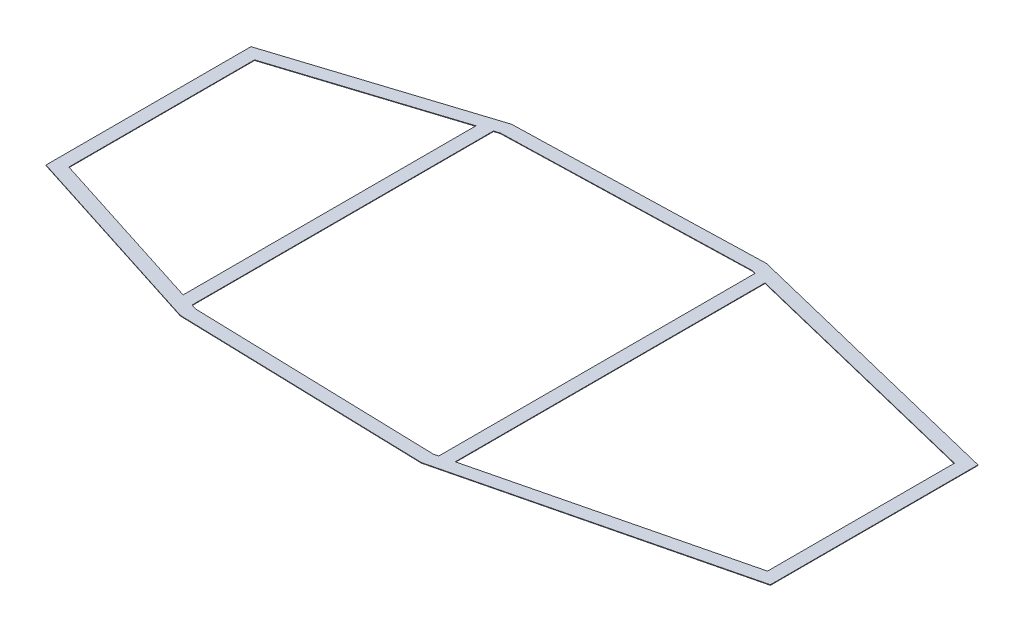
ISO-10303-21;
HEADER;
FILE_DESCRIPTION(('STEP AP214'),'2;1');
FILE_NAME('part.step','',(''),(''),'','','');
FILE_SCHEMA(('AUTOMOTIVE_DESIGN { 1 0 10303 214 1 1 1 1 }'));
ENDSEC;
DATA;
#1=APPLICATION_CONTEXT('core data for automotive mechanical design processes');
#2=APPLICATION_PROTOCOL_DEFINITION('international standard','automotive_design',2000,#1);
#3=PRODUCT_CONTEXT('',#1,'mechanical');
#4=PRODUCT('Part','Part','',(#3));
#5=PRODUCT_RELATED_PRODUCT_CATEGORY('part','',(#4));
#6=PRODUCT_DEFINITION_FORMATION('','',#4);
#7=PRODUCT_DEFINITION_CONTEXT('part definition',#1,'design');
#8=PRODUCT_DEFINITION('design','',#6,#7);
#9=PRODUCT_DEFINITION_SHAPE('','',#8);
#10=(LENGTH_UNIT() NAMED_UNIT(*) SI_UNIT(.MILLI.,.METRE.));
#11=(NAMED_UNIT(*) PLANE_ANGLE_UNIT() SI_UNIT($,.RADIAN.));
#12=(NAMED_UNIT(*) SI_UNIT($,.STERADIAN.) SOLID_ANGLE_UNIT());
#13=UNCERTAINTY_MEASURE_WITH_UNIT(LENGTH_MEASURE(1.E-05),#10,'distance_accuracy_value','');
#14=(GEOMETRIC_REPRESENTATION_CONTEXT(3) GLOBAL_UNCERTAINTY_ASSIGNED_CONTEXT((#13)) GLOBAL_UNIT_ASSIGNED_CONTEXT((#10,
#11,#12)) REPRESENTATION_CONTEXT('',''));
#15=CARTESIAN_POINT('',(0.,0.,0.));
#16=DIRECTION('',(0.,0.,1.));
#17=DIRECTION('',(1.,0.,0.));
#18=AXIS2_PLACEMENT_3D('',#15,#16,#17);
#19=CARTESIAN_POINT('',(708.,61.3,193.60723204996));
#20=DIRECTION('',(0.,-1.,0.));
#21=DIRECTION('',(0.,0.,-1.));
#22=AXIS2_PLACEMENT_3D('',#19,#20,#21);
#23=PLANE('',#22);
#24=DIRECTION('',(0.95256986702521,0.,0.304319977056343));
#25=VECTOR('',#24,1.);
#26=CARTESIAN_POINT('',(1050.,61.3,276.622068956592));
#27=LINE('',#26,#25);
#28=CARTESIAN_POINT('',(733.,61.3,175.349253107266));
#29=VERTEX_POINT('',#28);
#30=CARTESIAN_POINT('',(1050.,61.3,276.622068956592));
#31=VERTEX_POINT('',#30);
#32=EDGE_CURVE('E232',#29,#31,#27,.T.);
#33=ORIENTED_EDGE('',*,*,#32,.F.);
#34=DIRECTION('',(0.,0.,1.));
#35=VECTOR('',#34,1.);
#36=CARTESIAN_POINT('',(733.,61.3,175.349253107266));
#37=LINE('',#36,#35);
#38=CARTESIAN_POINT('',(733.,61.3,-175.349253107266));
#39=VERTEX_POINT('',#38);
#40=EDGE_CURVE('E240',#39,#29,#37,.T.);
#41=ORIENTED_EDGE('',*,*,#40,.F.);
#42=DIRECTION('',(-0.95256986702521,0.,0.304319977056343));
#43=VECTOR('',#42,1.);
#44=CARTESIAN_POINT('',(1050.,61.3,-276.622068956592));
#45=LINE('',#44,#43);
#46=CARTESIAN_POINT('',(1050.,61.3,-276.622068956592));
#47=VERTEX_POINT('',#46);
#48=EDGE_CURVE('E237',#47,#39,#45,.T.);
#49=ORIENTED_EDGE('',*,*,#48,.F.);
#50=DIRECTION('',(0.,0.,-1.));
#51=VECTOR('',#50,1.);
#52=CARTESIAN_POINT('',(1050.,61.3,276.622068956592));
#53=LINE('',#52,#51);
#54=EDGE_CURVE('E234',#31,#47,#53,.T.);
#55=ORIENTED_EDGE('',*,*,#54,.F.);
#56=EDGE_LOOP('',(#33,#41,#49,#55));
#57=FACE_BOUND('',#56,.T.);
#58=DIRECTION('',(0.95256986702521,0.,0.304319977056344));
#59=VECTOR('',#58,1.);
#60=CARTESIAN_POINT('',(1080.84743547171,61.3,312.721773603335));
#61=LINE('',#60,#59);
#62=CARTESIAN_POINT('',(708.,61.3,193.60723204996));
#63=VERTEX_POINT('',#62);
#64=CARTESIAN_POINT('',(1080.84743547171,61.3,312.721773603335));
#65=VERTEX_POINT('',#64);
#66=EDGE_CURVE('E322',#63,#65,#61,.T.);
#67=ORIENTED_EDGE('',*,*,#66,.T.);
#68=DIRECTION('',(0.999608031632854,0.,0.0279961264300995));
#69=VECTOR('',#68,1.);
#70=CARTESIAN_POINT('',(1549.46515586412,61.3,325.846398988808));
#71=LINE('',#70,#69);
#72=CARTESIAN_POINT('',(1549.46515586412,61.3,325.846398988808));
#73=VERTEX_POINT('',#72);
#74=EDGE_CURVE('E325',#65,#73,#71,.T.);
#75=ORIENTED_EDGE('',*,*,#74,.T.);
#76=DIRECTION('',(0.971239772329955,0.,-0.238103558655592));
#77=VECTOR('',#76,1.);
#78=CARTESIAN_POINT('',(1549.46515586412,61.3,325.846398988808));
#79=LINE('',#78,#77);
#80=CARTESIAN_POINT('',(2078.8,61.3,196.077711894373));
#81=VERTEX_POINT('',#80);
#82=EDGE_CURVE('E328',#73,#81,#79,.T.);
#83=ORIENTED_EDGE('',*,*,#82,.T.);
#84=DIRECTION('',(0.,0.,-1.));
#85=VECTOR('',#84,1.);
#86=CARTESIAN_POINT('',(2078.8,61.3,-196.077711894373));
#87=LINE('',#86,#85);
#88=CARTESIAN_POINT('',(2078.8,61.3,-196.077711894373));
#89=VERTEX_POINT('',#88);
#90=EDGE_CURVE('E330',#81,#89,#87,.T.);
#91=ORIENTED_EDGE('',*,*,#90,.T.);
#92=DIRECTION('',(-0.971239772329955,0.,-0.238103558655592));
#93=VECTOR('',#92,1.);
#94=CARTESIAN_POINT('',(1549.46515586412,61.3,-325.846398988808));
#95=LINE('',#94,#93);
#96=CARTESIAN_POINT('',(1549.46515586412,61.3,-325.846398988808));
#97=VERTEX_POINT('',#96);
#98=EDGE_CURVE('E332',#89,#97,#95,.T.);
#99=ORIENTED_EDGE('',*,*,#98,.T.);
#100=DIRECTION('',(-0.999608031632854,0.,0.027996126430099));
#101=VECTOR('',#100,1.);
#102=CARTESIAN_POINT('',(1549.46515586412,61.3,-325.846398988808));
#103=LINE('',#102,#101);
#104=CARTESIAN_POINT('',(1080.84743547171,61.3,-312.721773603336));
#105=VERTEX_POINT('',#104);
#106=EDGE_CURVE('E334',#97,#105,#103,.T.);
#107=ORIENTED_EDGE('',*,*,#106,.T.);
#108=DIRECTION('',(-0.95256986702521,0.,0.304319977056344));
#109=VECTOR('',#108,1.);
#110=CARTESIAN_POINT('',(1080.84743547171,61.3,-312.721773603336));
#111=LINE('',#110,#109);
#112=CARTESIAN_POINT('',(708.,61.3,-193.60723204996));
#113=VERTEX_POINT('',#112);
#114=EDGE_CURVE('E336',#105,#113,#111,.T.);
#115=ORIENTED_EDGE('',*,*,#114,.T.);
#116=DIRECTION('',(0.,0.,1.));
#117=VECTOR('',#116,1.);
#118=CARTESIAN_POINT('',(708.,61.3,193.60723204996));
#119=LINE('',#118,#117);
#120=EDGE_CURVE('E338',#113,#63,#119,.T.);
#121=ORIENTED_EDGE('',*,*,#120,.T.);
#122=EDGE_LOOP('',(#67,#75,#83,#91,#99,#107,#115,#121));
#123=FACE_BOUND('',#122,.T.);
#124=DIRECTION('',(0.,0.,-1.));
#125=VECTOR('',#124,1.);
#126=CARTESIAN_POINT('',(1555.,61.3,298.749211625669));
#127=LINE('',#126,#125);
#128=CARTESIAN_POINT('',(1555.,61.3,298.749211625669));
#129=VERTEX_POINT('',#128);
#130=CARTESIAN_POINT('',(1555.,61.3,-298.749211625669));
#131=VERTEX_POINT('',#130);
#132=EDGE_CURVE('E263',#129,#131,#127,.T.);
#133=ORIENTED_EDGE('',*,*,#132,.F.);
#134=DIRECTION('',(0.971239772329954,0.,-0.238103558655595));
#135=VECTOR('',#134,1.);
#136=CARTESIAN_POINT('',(1546.79093518472,61.3,300.761698759576));
#137=LINE('',#136,#135);
#138=CARTESIAN_POINT('',(1546.79093518472,61.3,300.761698759576));
#139=VERTEX_POINT('',#138);
#140=EDGE_CURVE('E279',#139,#129,#137,.T.);
#141=ORIENTED_EDGE('',*,*,#140,.F.);
#142=DIRECTION('',(0.999608031632855,0.,0.0279961264300995));
#143=VECTOR('',#142,1.);
#144=CARTESIAN_POINT('',(1546.79093518472,61.3,300.761698759576));
#145=LINE('',#144,#143);
#146=CARTESIAN_POINT('',(1085.08461283027,61.3,287.830641620012));
#147=VERTEX_POINT('',#146);
#148=EDGE_CURVE('E276',#147,#139,#145,.T.);
#149=ORIENTED_EDGE('',*,*,#148,.F.);
#150=DIRECTION('',(0.95256986702521,0.,0.304319977056344));
#151=VECTOR('',#150,1.);
#152=CARTESIAN_POINT('',(1085.08461283027,61.3,287.830641620012));
#153=LINE('',#152,#151);
#154=CARTESIAN_POINT('',(1075.,61.3,284.608884086665));
#155=VERTEX_POINT('',#154);
#156=EDGE_CURVE('E274',#155,#147,#153,.T.);
#157=ORIENTED_EDGE('',*,*,#156,.F.);
#158=DIRECTION('',(0.,0.,1.));
#159=VECTOR('',#158,1.);
#160=CARTESIAN_POINT('',(1075.,61.3,284.608884086665));
#161=LINE('',#160,#159);
#162=CARTESIAN_POINT('',(1075.,61.3,-284.608884086665));
#163=VERTEX_POINT('',#162);
#164=EDGE_CURVE('E272',#163,#155,#161,.T.);
#165=ORIENTED_EDGE('',*,*,#164,.F.);
#166=DIRECTION('',(-0.95256986702521,0.,0.304319977056344));
#167=VECTOR('',#166,1.);
#168=CARTESIAN_POINT('',(1085.08461283027,61.3,-287.830641620013));
#169=LINE('',#168,#167);
#170=CARTESIAN_POINT('',(1085.08461283027,61.3,-287.830641620013));
#171=VERTEX_POINT('',#170);
#172=EDGE_CURVE('E270',#171,#163,#169,.T.);
#173=ORIENTED_EDGE('',*,*,#172,.F.);
#174=DIRECTION('',(-0.999608031632854,0.,0.0279961264300998));
#175=VECTOR('',#174,1.);
#176=CARTESIAN_POINT('',(1548.049652364,61.3,-300.796951782938));
#177=LINE('',#176,#175);
#178=CARTESIAN_POINT('',(1548.049652364,61.3,-300.796951782938));
#179=VERTEX_POINT('',#178);
#180=EDGE_CURVE('E268',#179,#171,#177,.T.);
#181=ORIENTED_EDGE('',*,*,#180,.F.);
#182=DIRECTION('',(-0.959233880167307,0.,-0.282613451801523));
#183=VECTOR('',#182,1.);
#184=CARTESIAN_POINT('',(1555.,61.3,-298.749211625669));
#185=LINE('',#184,#183);
#186=EDGE_CURVE('E265',#131,#179,#185,.T.);
#187=ORIENTED_EDGE('',*,*,#186,.F.);
#188=EDGE_LOOP('',(#133,#141,#149,#157,#165,#173,#181,#187));
#189=FACE_BOUND('',#188,.T.);
#190=DIRECTION('',(0.,0.,1.));
#191=VECTOR('',#190,1.);
#192=CARTESIAN_POINT('',(1580.,61.3,292.620355357654));
#193=LINE('',#192,#191);
#194=CARTESIAN_POINT('',(1580.,61.3,-292.620355357654));
#195=VERTEX_POINT('',#194);
#196=CARTESIAN_POINT('',(1580.,61.3,292.620355357654));
#197=VERTEX_POINT('',#196);
#198=EDGE_CURVE('E196',#195,#197,#193,.T.);
#199=ORIENTED_EDGE('',*,*,#198,.F.);
#200=DIRECTION('',(-0.971239772329955,0.,-0.238103558655592));
#201=VECTOR('',#200,1.);
#202=CARTESIAN_POINT('',(1580.,61.3,-292.620355357654));
#203=LINE('',#202,#201);
#204=CARTESIAN_POINT('',(2053.8,61.3,-176.466271366236));
#205=VERTEX_POINT('',#204);
#206=EDGE_CURVE('E218',#205,#195,#203,.T.);
#207=ORIENTED_EDGE('',*,*,#206,.F.);
#208=DIRECTION('',(0.,0.,-1.));
#209=VECTOR('',#208,1.);
#210=CARTESIAN_POINT('',(2053.8,61.3,-176.466271366236));
#211=LINE('',#210,#209);
#212=CARTESIAN_POINT('',(2053.8,61.3,176.466271366236));
#213=VERTEX_POINT('',#212);
#214=EDGE_CURVE('E216',#213,#205,#211,.T.);
#215=ORIENTED_EDGE('',*,*,#214,.F.);
#216=DIRECTION('',(0.971239772329955,0.,-0.238103558655592));
#217=VECTOR('',#216,1.);
#218=CARTESIAN_POINT('',(1580.,61.3,292.620355357654));
#219=LINE('',#218,#217);
#220=EDGE_CURVE('E204',#197,#213,#219,.T.);
#221=ORIENTED_EDGE('',*,*,#220,.F.);
#222=EDGE_LOOP('',(#199,#207,#215,#221));
#223=FACE_BOUND('',#222,.T.);
#224=ADVANCED_FACE('F35',(#57,#123,#189,#223),#23,.F.);
#225=CARTESIAN_POINT('',(708.,60.3,193.60723204996));
#226=DIRECTION('',(0.,-1.,0.));
#227=DIRECTION('',(0.,0.,-1.));
#228=AXIS2_PLACEMENT_3D('',#225,#226,#227);
#229=PLANE('',#228);
#230=DIRECTION('',(0.,0.,1.));
#231=VECTOR('',#230,1.);
#232=CARTESIAN_POINT('',(733.,60.3,175.349253107266));
#233=LINE('',#232,#231);
#234=CARTESIAN_POINT('',(733.,60.3,-175.349253107266));
#235=VERTEX_POINT('',#234);
#236=CARTESIAN_POINT('',(733.,60.3,175.349253107266));
#237=VERTEX_POINT('',#236);
#238=EDGE_CURVE('E235',#235,#237,#233,.T.);
#239=ORIENTED_EDGE('',*,*,#238,.T.);
#240=DIRECTION('',(0.95256986702521,0.,0.304319977056343));
#241=VECTOR('',#240,1.);
#242=CARTESIAN_POINT('',(1050.,60.3,276.622068956592));
#243=LINE('',#242,#241);
#244=CARTESIAN_POINT('',(1050.,60.3,276.622068956592));
#245=VERTEX_POINT('',#244);
#246=EDGE_CURVE('E212',#237,#245,#243,.T.);
#247=ORIENTED_EDGE('',*,*,#246,.T.);
#248=DIRECTION('',(0.,0.,-1.));
#249=VECTOR('',#248,1.);
#250=CARTESIAN_POINT('',(1050.,60.3,276.622068956592));
#251=LINE('',#250,#249);
#252=CARTESIAN_POINT('',(1050.,60.3,-276.622068956592));
#253=VERTEX_POINT('',#252);
#254=EDGE_CURVE('E245',#245,#253,#251,.T.);
#255=ORIENTED_EDGE('',*,*,#254,.T.);
#256=DIRECTION('',(-0.95256986702521,0.,0.304319977056343));
#257=VECTOR('',#256,1.);
#258=CARTESIAN_POINT('',(1050.,60.3,-276.622068956592));
#259=LINE('',#258,#257);
#260=EDGE_CURVE('E248',#253,#235,#259,.T.);
#261=ORIENTED_EDGE('',*,*,#260,.T.);
#262=EDGE_LOOP('',(#239,#247,#255,#261));
#263=FACE_BOUND('',#262,.T.);
#264=DIRECTION('',(0.95256986702521,0.,0.304319977056344));
#265=VECTOR('',#264,1.);
#266=CARTESIAN_POINT('',(1080.84743547171,60.3,312.721773603335));
#267=LINE('',#266,#265);
#268=CARTESIAN_POINT('',(708.,60.3,193.60723204996));
#269=VERTEX_POINT('',#268);
#270=CARTESIAN_POINT('',(1080.84743547171,60.3,312.721773603335));
#271=VERTEX_POINT('',#270);
#272=EDGE_CURVE('E321',#269,#271,#267,.T.);
#273=ORIENTED_EDGE('',*,*,#272,.F.);
#274=DIRECTION('',(0.,0.,1.));
#275=VECTOR('',#274,1.);
#276=CARTESIAN_POINT('',(708.,60.3,193.60723204996));
#277=LINE('',#276,#275);
#278=CARTESIAN_POINT('',(708.,60.3,-193.60723204996));
#279=VERTEX_POINT('',#278);
#280=EDGE_CURVE('E326',#279,#269,#277,.T.);
#281=ORIENTED_EDGE('',*,*,#280,.F.);
#282=DIRECTION('',(-0.95256986702521,0.,0.304319977056344));
#283=VECTOR('',#282,1.);
#284=CARTESIAN_POINT('',(1080.84743547171,60.3,-312.721773603336));
#285=LINE('',#284,#283);
#286=CARTESIAN_POINT('',(1080.84743547171,60.3,-312.721773603336));
#287=VERTEX_POINT('',#286);
#288=EDGE_CURVE('E353',#287,#279,#285,.T.);
#289=ORIENTED_EDGE('',*,*,#288,.F.);
#290=DIRECTION('',(-0.999608031632854,0.,0.027996126430099));
#291=VECTOR('',#290,1.);
#292=CARTESIAN_POINT('',(1549.46515586412,60.3,-325.846398988808));
#293=LINE('',#292,#291);
#294=CARTESIAN_POINT('',(1549.46515586412,60.3,-325.846398988808));
#295=VERTEX_POINT('',#294);
#296=EDGE_CURVE('E351',#295,#287,#293,.T.);
#297=ORIENTED_EDGE('',*,*,#296,.F.);
#298=DIRECTION('',(-0.971239772329955,0.,-0.238103558655592));
#299=VECTOR('',#298,1.);
#300=CARTESIAN_POINT('',(1549.46515586412,60.3,-325.846398988808));
#301=LINE('',#300,#299);
#302=CARTESIAN_POINT('',(2078.8,60.3,-196.077711894373));
#303=VERTEX_POINT('',#302);
#304=EDGE_CURVE('E349',#303,#295,#301,.T.);
#305=ORIENTED_EDGE('',*,*,#304,.F.);
#306=DIRECTION('',(0.,0.,-1.));
#307=VECTOR('',#306,1.);
#308=CARTESIAN_POINT('',(2078.8,60.3,-196.077711894373));
#309=LINE('',#308,#307);
#310=CARTESIAN_POINT('',(2078.8,60.3,196.077711894373));
#311=VERTEX_POINT('',#310);
#312=EDGE_CURVE('E347',#311,#303,#309,.T.);
#313=ORIENTED_EDGE('',*,*,#312,.F.);
#314=DIRECTION('',(0.971239772329955,0.,-0.238103558655592));
#315=VECTOR('',#314,1.);
#316=CARTESIAN_POINT('',(1549.46515586412,60.3,325.846398988808));
#317=LINE('',#316,#315);
#318=CARTESIAN_POINT('',(1549.46515586412,60.3,325.846398988808));
#319=VERTEX_POINT('',#318);
#320=EDGE_CURVE('E345',#319,#311,#317,.T.);
#321=ORIENTED_EDGE('',*,*,#320,.F.);
#322=DIRECTION('',(0.999608031632854,0.,0.0279961264300995));
#323=VECTOR('',#322,1.);
#324=CARTESIAN_POINT('',(1549.46515586412,60.3,325.846398988808));
#325=LINE('',#324,#323);
#326=EDGE_CURVE('E343',#271,#319,#325,.T.);
#327=ORIENTED_EDGE('',*,*,#326,.F.);
#328=EDGE_LOOP('',(#273,#281,#289,#297,#305,#313,#321,#327));
#329=FACE_BOUND('',#328,.T.);
#330=DIRECTION('',(0.971239772329954,0.,-0.238103558655595));
#331=VECTOR('',#330,1.);
#332=CARTESIAN_POINT('',(1546.79093518472,60.3,300.761698759576));
#333=LINE('',#332,#331);
#334=CARTESIAN_POINT('',(1546.79093518472,60.3,300.761698759576));
#335=VERTEX_POINT('',#334);
#336=CARTESIAN_POINT('',(1555.,60.3,298.749211625669));
#337=VERTEX_POINT('',#336);
#338=EDGE_CURVE('E266',#335,#337,#333,.T.);
#339=ORIENTED_EDGE('',*,*,#338,.T.);
#340=DIRECTION('',(0.,0.,-1.));
#341=VECTOR('',#340,1.);
#342=CARTESIAN_POINT('',(1555.,60.3,298.749211625669));
#343=LINE('',#342,#341);
#344=CARTESIAN_POINT('',(1555.,60.3,-298.749211625669));
#345=VERTEX_POINT('',#344);
#346=EDGE_CURVE('E262',#337,#345,#343,.T.);
#347=ORIENTED_EDGE('',*,*,#346,.T.);
#348=DIRECTION('',(-0.959233880167307,0.,-0.282613451801523));
#349=VECTOR('',#348,1.);
#350=CARTESIAN_POINT('',(1555.,60.3,-298.749211625669));
#351=LINE('',#350,#349);
#352=CARTESIAN_POINT('',(1548.049652364,60.3,-300.796951782938));
#353=VERTEX_POINT('',#352);
#354=EDGE_CURVE('E284',#345,#353,#351,.T.);
#355=ORIENTED_EDGE('',*,*,#354,.T.);
#356=DIRECTION('',(-0.999608031632854,0.,0.0279961264300998));
#357=VECTOR('',#356,1.);
#358=CARTESIAN_POINT('',(1548.049652364,60.3,-300.796951782938));
#359=LINE('',#358,#357);
#360=CARTESIAN_POINT('',(1085.08461283027,60.3,-287.830641620013));
#361=VERTEX_POINT('',#360);
#362=EDGE_CURVE('E287',#353,#361,#359,.T.);
#363=ORIENTED_EDGE('',*,*,#362,.T.);
#364=DIRECTION('',(-0.95256986702521,0.,0.304319977056344));
#365=VECTOR('',#364,1.);
#366=CARTESIAN_POINT('',(1085.08461283027,60.3,-287.830641620013));
#367=LINE('',#366,#365);
#368=CARTESIAN_POINT('',(1075.,60.3,-284.608884086665));
#369=VERTEX_POINT('',#368);
#370=EDGE_CURVE('E290',#361,#369,#367,.T.);
#371=ORIENTED_EDGE('',*,*,#370,.T.);
#372=DIRECTION('',(0.,0.,1.));
#373=VECTOR('',#372,1.);
#374=CARTESIAN_POINT('',(1075.,60.3,284.608884086665));
#375=LINE('',#374,#373);
#376=CARTESIAN_POINT('',(1075.,60.3,284.608884086665));
#377=VERTEX_POINT('',#376);
#378=EDGE_CURVE('E293',#369,#377,#375,.T.);
#379=ORIENTED_EDGE('',*,*,#378,.T.);
#380=DIRECTION('',(0.95256986702521,0.,0.304319977056344));
#381=VECTOR('',#380,1.);
#382=CARTESIAN_POINT('',(1085.08461283027,60.3,287.830641620012));
#383=LINE('',#382,#381);
#384=CARTESIAN_POINT('',(1085.08461283027,60.3,287.830641620012));
#385=VERTEX_POINT('',#384);
#386=EDGE_CURVE('E296',#377,#385,#383,.T.);
#387=ORIENTED_EDGE('',*,*,#386,.T.);
#388=DIRECTION('',(0.999608031632855,0.,0.0279961264300995));
#389=VECTOR('',#388,1.);
#390=CARTESIAN_POINT('',(1546.79093518472,60.3,300.761698759576));
#391=LINE('',#390,#389);
#392=EDGE_CURVE('E299',#385,#335,#391,.T.);
#393=ORIENTED_EDGE('',*,*,#392,.T.);
#394=EDGE_LOOP('',(#339,#347,#355,#363,#371,#379,#387,#393));
#395=FACE_BOUND('',#394,.T.);
#396=DIRECTION('',(-0.971239772329955,0.,-0.238103558655592));
#397=VECTOR('',#396,1.);
#398=CARTESIAN_POINT('',(1580.,60.3,-292.620355357654));
#399=LINE('',#398,#397);
#400=CARTESIAN_POINT('',(2053.8,60.3,-176.466271366236));
#401=VERTEX_POINT('',#400);
#402=CARTESIAN_POINT('',(1580.,60.3,-292.620355357654));
#403=VERTEX_POINT('',#402);
#404=EDGE_CURVE('E205',#401,#403,#399,.T.);
#405=ORIENTED_EDGE('',*,*,#404,.T.);
#406=DIRECTION('',(0.,0.,1.));
#407=VECTOR('',#406,1.);
#408=CARTESIAN_POINT('',(1580.,60.3,292.620355357654));
#409=LINE('',#408,#407);
#410=CARTESIAN_POINT('',(1580.,60.3,292.620355357654));
#411=VERTEX_POINT('',#410);
#412=EDGE_CURVE('E58',#403,#411,#409,.T.);
#413=ORIENTED_EDGE('',*,*,#412,.T.);
#414=DIRECTION('',(0.971239772329955,0.,-0.238103558655592));
#415=VECTOR('',#414,1.);
#416=CARTESIAN_POINT('',(1580.,60.3,292.620355357654));
#417=LINE('',#416,#415);
#418=CARTESIAN_POINT('',(2053.8,60.3,176.466271366236));
#419=VERTEX_POINT('',#418);
#420=EDGE_CURVE('E211',#411,#419,#417,.T.);
#421=ORIENTED_EDGE('',*,*,#420,.T.);
#422=DIRECTION('',(0.,0.,-1.));
#423=VECTOR('',#422,1.);
#424=CARTESIAN_POINT('',(2053.8,60.3,-176.466271366236));
#425=LINE('',#424,#423);
#426=EDGE_CURVE('E224',#419,#401,#425,.T.);
#427=ORIENTED_EDGE('',*,*,#426,.T.);
#428=EDGE_LOOP('',(#405,#413,#421,#427));
#429=FACE_BOUND('',#428,.T.);
#430=ADVANCED_FACE('F383',(#263,#329,#395,#429),#229,.T.);
#431=CARTESIAN_POINT('',(1080.84743547171,61.3,312.721773603335));
#432=DIRECTION('',(0.304319977056344,0.,-0.95256986702521));
#433=DIRECTION('',(-0.95256986702521,0.,-0.304319977056344));
#434=AXIS2_PLACEMENT_3D('',#431,#432,#433);
#435=PLANE('',#434);
#436=ORIENTED_EDGE('',*,*,#272,.T.);
#437=DIRECTION('',(0.,-1.,0.));
#438=VECTOR('',#437,1.);
#439=CARTESIAN_POINT('',(1080.84743547171,61.3,312.721773603335));
#440=LINE('',#439,#438);
#441=EDGE_CURVE('E11',#65,#271,#440,.T.);
#442=ORIENTED_EDGE('',*,*,#441,.F.);
#443=ORIENTED_EDGE('',*,*,#66,.F.);
#444=DIRECTION('',(0.,-1.,0.));
#445=VECTOR('',#444,1.);
#446=CARTESIAN_POINT('',(708.,61.3,193.60723204996));
#447=LINE('',#446,#445);
#448=EDGE_CURVE('E340',#63,#269,#447,.T.);
#449=ORIENTED_EDGE('',*,*,#448,.T.);
#450=EDGE_LOOP('',(#436,#442,#443,#449));
#451=FACE_BOUND('',#450,.T.);
#452=ADVANCED_FACE('F37',(#451),#435,.F.);
#453=CARTESIAN_POINT('',(1549.46515586412,61.3,325.846398988808));
#454=DIRECTION('',(0.0279961264300995,0.,-0.999608031632855));
#455=DIRECTION('',(-0.999608031632854,0.,-0.0279961264300995));
#456=AXIS2_PLACEMENT_3D('',#453,#454,#455);
#457=PLANE('',#456);
#458=ORIENTED_EDGE('',*,*,#326,.T.);
#459=DIRECTION('',(0.,-1.,0.));
#460=VECTOR('',#459,1.);
#461=CARTESIAN_POINT('',(1549.46515586412,61.3,325.846398988808));
#462=LINE('',#461,#460);
#463=EDGE_CURVE('E43',#73,#319,#462,.T.);
#464=ORIENTED_EDGE('',*,*,#463,.F.);
#465=ORIENTED_EDGE('',*,*,#74,.F.);
#466=ORIENTED_EDGE('',*,*,#441,.T.);
#467=EDGE_LOOP('',(#458,#464,#465,#466));
#468=FACE_BOUND('',#467,.T.);
#469=ADVANCED_FACE('F401',(#468),#457,.F.);
#470=CARTESIAN_POINT('',(1549.46515586412,61.3,325.846398988808));
#471=DIRECTION('',(-0.238103558655592,0.,-0.971239772329955));
#472=DIRECTION('',(-0.971239772329955,0.,0.238103558655592));
#473=AXIS2_PLACEMENT_3D('',#470,#471,#472);
#474=PLANE('',#473);
#475=ORIENTED_EDGE('',*,*,#320,.T.);
#476=DIRECTION('',(0.,-1.,0.));
#477=VECTOR('',#476,1.);
#478=CARTESIAN_POINT('',(2078.8,61.3,196.077711894373));
#479=LINE('',#478,#477);
#480=EDGE_CURVE('E370',#81,#311,#479,.T.);
#481=ORIENTED_EDGE('',*,*,#480,.F.);
#482=ORIENTED_EDGE('',*,*,#82,.F.);
#483=ORIENTED_EDGE('',*,*,#463,.T.);
#484=EDGE_LOOP('',(#475,#481,#482,#483));
#485=FACE_BOUND('',#484,.T.);
#486=ADVANCED_FACE('F377',(#485),#474,.F.);
#487=CARTESIAN_POINT('',(2078.8,61.3,-196.077711894373));
#488=DIRECTION('',(-1.,0.,0.));
#489=DIRECTION('',(0.,0.,1.));
#490=AXIS2_PLACEMENT_3D('',#487,#488,#489);
#491=PLANE('',#490);
#492=ORIENTED_EDGE('',*,*,#312,.T.);
#493=DIRECTION('',(0.,-1.,0.));
#494=VECTOR('',#493,1.);
#495=CARTESIAN_POINT('',(2078.8,61.3,-196.077711894373));
#496=LINE('',#495,#494);
#497=EDGE_CURVE('E367',#89,#303,#496,.T.);
#498=ORIENTED_EDGE('',*,*,#497,.F.);
#499=ORIENTED_EDGE('',*,*,#90,.F.);
#500=ORIENTED_EDGE('',*,*,#480,.T.);
#501=EDGE_LOOP('',(#492,#498,#499,#500));
#502=FACE_BOUND('',#501,.T.);
#503=ADVANCED_FACE('F389',(#502),#491,.F.);
#504=CARTESIAN_POINT('',(1549.46515586412,61.3,-325.846398988808));
#505=DIRECTION('',(-0.238103558655592,0.,0.971239772329955));
#506=DIRECTION('',(0.971239772329955,0.,0.238103558655592));
#507=AXIS2_PLACEMENT_3D('',#504,#505,#506);
#508=PLANE('',#507);
#509=ORIENTED_EDGE('',*,*,#304,.T.);
#510=DIRECTION('',(0.,-1.,0.));
#511=VECTOR('',#510,1.);
#512=CARTESIAN_POINT('',(1549.46515586412,61.3,-325.846398988808));
#513=LINE('',#512,#511);
#514=EDGE_CURVE('E364',#97,#295,#513,.T.);
#515=ORIENTED_EDGE('',*,*,#514,.F.);
#516=ORIENTED_EDGE('',*,*,#98,.F.);
#517=ORIENTED_EDGE('',*,*,#497,.T.);
#518=EDGE_LOOP('',(#509,#515,#516,#517));
#519=FACE_BOUND('',#518,.T.);
#520=ADVANCED_FACE('F393',(#519),#508,.F.);
#521=CARTESIAN_POINT('',(1549.46515586412,61.3,-325.846398988808));
#522=DIRECTION('',(0.027996126430099,0.,0.999608031632855));
#523=DIRECTION('',(0.999608031632854,0.,-0.027996126430099));
#524=AXIS2_PLACEMENT_3D('',#521,#522,#523);
#525=PLANE('',#524);
#526=ORIENTED_EDGE('',*,*,#296,.T.);
#527=DIRECTION('',(0.,-1.,0.));
#528=VECTOR('',#527,1.);
#529=CARTESIAN_POINT('',(1080.84743547171,61.3,-312.721773603336));
#530=LINE('',#529,#528);
#531=EDGE_CURVE('E361',#105,#287,#530,.T.);
#532=ORIENTED_EDGE('',*,*,#531,.F.);
#533=ORIENTED_EDGE('',*,*,#106,.F.);
#534=ORIENTED_EDGE('',*,*,#514,.T.);
#535=EDGE_LOOP('',(#526,#532,#533,#534));
#536=FACE_BOUND('',#535,.T.);
#537=ADVANCED_FACE('F414',(#536),#525,.F.);
#538=CARTESIAN_POINT('',(1080.84743547171,61.3,-312.721773603336));
#539=DIRECTION('',(0.304319977056344,0.,0.95256986702521));
#540=DIRECTION('',(0.95256986702521,0.,-0.304319977056344));
#541=AXIS2_PLACEMENT_3D('',#538,#539,#540);
#542=PLANE('',#541);
#543=ORIENTED_EDGE('',*,*,#288,.T.);
#544=DIRECTION('',(0.,-1.,0.));
#545=VECTOR('',#544,1.);
#546=CARTESIAN_POINT('',(708.,61.3,-193.60723204996));
#547=LINE('',#546,#545);
#548=EDGE_CURVE('E358',#113,#279,#547,.T.);
#549=ORIENTED_EDGE('',*,*,#548,.F.);
#550=ORIENTED_EDGE('',*,*,#114,.F.);
#551=ORIENTED_EDGE('',*,*,#531,.T.);
#552=EDGE_LOOP('',(#543,#549,#550,#551));
#553=FACE_BOUND('',#552,.T.);
#554=ADVANCED_FACE('F412',(#553),#542,.F.);
#555=CARTESIAN_POINT('',(708.,61.3,193.60723204996));
#556=DIRECTION('',(1.,0.,0.));
#557=DIRECTION('',(0.,0.,-1.));
#558=AXIS2_PLACEMENT_3D('',#555,#556,#557);
#559=PLANE('',#558);
#560=ORIENTED_EDGE('',*,*,#280,.T.);
#561=ORIENTED_EDGE('',*,*,#448,.F.);
#562=ORIENTED_EDGE('',*,*,#120,.F.);
#563=ORIENTED_EDGE('',*,*,#548,.T.);
#564=EDGE_LOOP('',(#560,#561,#562,#563));
#565=FACE_BOUND('',#564,.T.);
#566=ADVANCED_FACE('F407',(#565),#559,.F.);
#567=CARTESIAN_POINT('',(1555.,61.3,298.749211625669));
#568=DIRECTION('',(-1.,0.,0.));
#569=DIRECTION('',(0.,0.,1.));
#570=AXIS2_PLACEMENT_3D('',#567,#568,#569);
#571=PLANE('',#570);
#572=ORIENTED_EDGE('',*,*,#346,.F.);
#573=DIRECTION('',(0.,-1.,0.));
#574=VECTOR('',#573,1.);
#575=CARTESIAN_POINT('',(1555.,61.3,298.749211625669));
#576=LINE('',#575,#574);
#577=EDGE_CURVE('E281',#129,#337,#576,.T.);
#578=ORIENTED_EDGE('',*,*,#577,.F.);
#579=ORIENTED_EDGE('',*,*,#132,.T.);
#580=DIRECTION('',(0.,-1.,0.));
#581=VECTOR('',#580,1.);
#582=CARTESIAN_POINT('',(1555.,61.3,-298.749211625669));
#583=LINE('',#582,#581);
#584=EDGE_CURVE('E318',#131,#345,#583,.T.);
#585=ORIENTED_EDGE('',*,*,#584,.T.);
#586=EDGE_LOOP('',(#572,#578,#579,#585));
#587=FACE_BOUND('',#586,.T.);
#588=ADVANCED_FACE('F433',(#587),#571,.T.);
#589=CARTESIAN_POINT('',(1555.,61.3,-298.749211625669));
#590=DIRECTION('',(-0.282613451801523,0.,0.959233880167307));
#591=DIRECTION('',(0.959233880167307,0.,0.282613451801523));
#592=AXIS2_PLACEMENT_3D('',#589,#590,#591);
#593=PLANE('',#592);
#594=ORIENTED_EDGE('',*,*,#354,.F.);
#595=ORIENTED_EDGE('',*,*,#584,.F.);
#596=ORIENTED_EDGE('',*,*,#186,.T.);
#597=DIRECTION('',(0.,-1.,0.));
#598=VECTOR('',#597,1.);
#599=CARTESIAN_POINT('',(1548.049652364,61.3,-300.796951782938));
#600=LINE('',#599,#598);
#601=EDGE_CURVE('E316',#179,#353,#600,.T.);
#602=ORIENTED_EDGE('',*,*,#601,.T.);
#603=EDGE_LOOP('',(#594,#595,#596,#602));
#604=FACE_BOUND('',#603,.T.);
#605=ADVANCED_FACE('F440',(#604),#593,.T.);
#606=CARTESIAN_POINT('',(1548.049652364,61.3,-300.796951782938));
#607=DIRECTION('',(0.0279961264300998,0.,0.999608031632855));
#608=DIRECTION('',(0.999608031632854,0.,-0.0279961264300998));
#609=AXIS2_PLACEMENT_3D('',#606,#607,#608);
#610=PLANE('',#609);
#611=ORIENTED_EDGE('',*,*,#362,.F.);
#612=ORIENTED_EDGE('',*,*,#601,.F.);
#613=ORIENTED_EDGE('',*,*,#180,.T.);
#614=DIRECTION('',(0.,-1.,0.));
#615=VECTOR('',#614,1.);
#616=CARTESIAN_POINT('',(1085.08461283027,61.3,-287.830641620013));
#617=LINE('',#616,#615);
#618=EDGE_CURVE('E314',#171,#361,#617,.T.);
#619=ORIENTED_EDGE('',*,*,#618,.T.);
#620=EDGE_LOOP('',(#611,#612,#613,#619));
#621=FACE_BOUND('',#620,.T.);
#622=ADVANCED_FACE('F445',(#621),#610,.T.);
#623=CARTESIAN_POINT('',(1085.08461283027,61.3,-287.830641620013));
#624=DIRECTION('',(0.304319977056344,0.,0.95256986702521));
#625=DIRECTION('',(0.95256986702521,0.,-0.304319977056344));
#626=AXIS2_PLACEMENT_3D('',#623,#624,#625);
#627=PLANE('',#626);
#628=ORIENTED_EDGE('',*,*,#370,.F.);
#629=ORIENTED_EDGE('',*,*,#618,.F.);
#630=ORIENTED_EDGE('',*,*,#172,.T.);
#631=DIRECTION('',(0.,-1.,0.));
#632=VECTOR('',#631,1.);
#633=CARTESIAN_POINT('',(1075.,61.3,-284.608884086665));
#634=LINE('',#633,#632);
#635=EDGE_CURVE('E312',#163,#369,#634,.T.);
#636=ORIENTED_EDGE('',*,*,#635,.T.);
#637=EDGE_LOOP('',(#628,#629,#630,#636));
#638=FACE_BOUND('',#637,.T.);
#639=ADVANCED_FACE('F471',(#638),#627,.T.);
#640=CARTESIAN_POINT('',(1075.,61.3,284.608884086665));
#641=DIRECTION('',(1.,0.,0.));
#642=DIRECTION('',(0.,0.,-1.));
#643=AXIS2_PLACEMENT_3D('',#640,#641,#642);
#644=PLANE('',#643);
#645=ORIENTED_EDGE('',*,*,#378,.F.);
#646=ORIENTED_EDGE('',*,*,#635,.F.);
#647=ORIENTED_EDGE('',*,*,#164,.T.);
#648=DIRECTION('',(0.,-1.,0.));
#649=VECTOR('',#648,1.);
#650=CARTESIAN_POINT('',(1075.,61.3,284.608884086665));
#651=LINE('',#650,#649);
#652=EDGE_CURVE('E310',#155,#377,#651,.T.);
#653=ORIENTED_EDGE('',*,*,#652,.T.);
#654=EDGE_LOOP('',(#645,#646,#647,#653));
#655=FACE_BOUND('',#654,.T.);
#656=ADVANCED_FACE('F476',(#655),#644,.T.);
#657=CARTESIAN_POINT('',(1085.08461283027,61.3,287.830641620012));
#658=DIRECTION('',(0.304319977056344,0.,-0.95256986702521));
#659=DIRECTION('',(-0.95256986702521,0.,-0.304319977056344));
#660=AXIS2_PLACEMENT_3D('',#657,#658,#659);
#661=PLANE('',#660);
#662=ORIENTED_EDGE('',*,*,#386,.F.);
#663=ORIENTED_EDGE('',*,*,#652,.F.);
#664=ORIENTED_EDGE('',*,*,#156,.T.);
#665=DIRECTION('',(0.,-1.,0.));
#666=VECTOR('',#665,1.);
#667=CARTESIAN_POINT('',(1085.08461283027,61.3,287.830641620012));
#668=LINE('',#667,#666);
#669=EDGE_CURVE('E308',#147,#385,#668,.T.);
#670=ORIENTED_EDGE('',*,*,#669,.T.);
#671=EDGE_LOOP('',(#662,#663,#664,#670));
#672=FACE_BOUND('',#671,.T.);
#673=ADVANCED_FACE('F479',(#672),#661,.T.);
#674=CARTESIAN_POINT('',(1546.79093518472,61.3,300.761698759576));
#675=DIRECTION('',(0.0279961264300995,0.,-0.999608031632855));
#676=DIRECTION('',(-0.999608031632854,0.,-0.0279961264300995));
#677=AXIS2_PLACEMENT_3D('',#674,#675,#676);
#678=PLANE('',#677);
#679=ORIENTED_EDGE('',*,*,#392,.F.);
#680=ORIENTED_EDGE('',*,*,#669,.F.);
#681=ORIENTED_EDGE('',*,*,#148,.T.);
#682=DIRECTION('',(0.,-1.,0.));
#683=VECTOR('',#682,1.);
#684=CARTESIAN_POINT('',(1546.79093518472,61.3,300.761698759576));
#685=LINE('',#684,#683);
#686=EDGE_CURVE('E306',#139,#335,#685,.T.);
#687=ORIENTED_EDGE('',*,*,#686,.T.);
#688=EDGE_LOOP('',(#679,#680,#681,#687));
#689=FACE_BOUND('',#688,.T.);
#690=ADVANCED_FACE('F459',(#689),#678,.T.);
#691=CARTESIAN_POINT('',(1546.79093518472,61.3,300.761698759576));
#692=DIRECTION('',(-0.238103558655596,0.,-0.971239772329954));
#693=DIRECTION('',(-0.971239772329954,0.,0.238103558655596));
#694=AXIS2_PLACEMENT_3D('',#691,#692,#693);
#695=PLANE('',#694);
#696=ORIENTED_EDGE('',*,*,#338,.F.);
#697=ORIENTED_EDGE('',*,*,#686,.F.);
#698=ORIENTED_EDGE('',*,*,#140,.T.);
#699=ORIENTED_EDGE('',*,*,#577,.T.);
#700=EDGE_LOOP('',(#696,#697,#698,#699));
#701=FACE_BOUND('',#700,.T.);
#702=ADVANCED_FACE('F452',(#701),#695,.T.);
#703=CARTESIAN_POINT('',(1050.,61.3,276.622068956592));
#704=DIRECTION('',(0.304319977056343,0.,-0.95256986702521));
#705=DIRECTION('',(-0.95256986702521,0.,-0.304319977056343));
#706=AXIS2_PLACEMENT_3D('',#703,#704,#705);
#707=PLANE('',#706);
#708=ORIENTED_EDGE('',*,*,#246,.F.);
#709=DIRECTION('',(0.,-1.,0.));
#710=VECTOR('',#709,1.);
#711=CARTESIAN_POINT('',(733.,61.3,175.349253107266));
#712=LINE('',#711,#710);
#713=EDGE_CURVE('E242',#29,#237,#712,.T.);
#714=ORIENTED_EDGE('',*,*,#713,.F.);
#715=ORIENTED_EDGE('',*,*,#32,.T.);
#716=DIRECTION('',(0.,-1.,0.));
#717=VECTOR('',#716,1.);
#718=CARTESIAN_POINT('',(1050.,61.3,276.622068956592));
#719=LINE('',#718,#717);
#720=EDGE_CURVE('E259',#31,#245,#719,.T.);
#721=ORIENTED_EDGE('',*,*,#720,.T.);
#722=EDGE_LOOP('',(#708,#714,#715,#721));
#723=FACE_BOUND('',#722,.T.);
#724=ADVANCED_FACE('F524',(#723),#707,.T.);
#725=CARTESIAN_POINT('',(1050.,61.3,276.622068956592));
#726=DIRECTION('',(-1.,0.,0.));
#727=DIRECTION('',(0.,0.,1.));
#728=AXIS2_PLACEMENT_3D('',#725,#726,#727);
#729=PLANE('',#728);
#730=ORIENTED_EDGE('',*,*,#254,.F.);
#731=ORIENTED_EDGE('',*,*,#720,.F.);
#732=ORIENTED_EDGE('',*,*,#54,.T.);
#733=DIRECTION('',(0.,-1.,0.));
#734=VECTOR('',#733,1.);
#735=CARTESIAN_POINT('',(1050.,61.3,-276.622068956592));
#736=LINE('',#735,#734);
#737=EDGE_CURVE('E257',#47,#253,#736,.T.);
#738=ORIENTED_EDGE('',*,*,#737,.T.);
#739=EDGE_LOOP('',(#730,#731,#732,#738));
#740=FACE_BOUND('',#739,.T.);
#741=ADVANCED_FACE('F532',(#740),#729,.T.);
#742=CARTESIAN_POINT('',(1050.,61.3,-276.622068956592));
#743=DIRECTION('',(0.304319977056343,0.,0.95256986702521));
#744=DIRECTION('',(0.95256986702521,0.,-0.304319977056343));
#745=AXIS2_PLACEMENT_3D('',#742,#743,#744);
#746=PLANE('',#745);
#747=ORIENTED_EDGE('',*,*,#260,.F.);
#748=ORIENTED_EDGE('',*,*,#737,.F.);
#749=ORIENTED_EDGE('',*,*,#48,.T.);
#750=DIRECTION('',(0.,-1.,0.));
#751=VECTOR('',#750,1.);
#752=CARTESIAN_POINT('',(733.,61.3,-175.349253107266));
#753=LINE('',#752,#751);
#754=EDGE_CURVE('E255',#39,#235,#753,.T.);
#755=ORIENTED_EDGE('',*,*,#754,.T.);
#756=EDGE_LOOP('',(#747,#748,#749,#755));
#757=FACE_BOUND('',#756,.T.);
#758=ADVANCED_FACE('F542',(#757),#746,.T.);
#759=CARTESIAN_POINT('',(733.,61.3,175.349253107266));
#760=DIRECTION('',(1.,0.,0.));
#761=DIRECTION('',(0.,0.,-1.));
#762=AXIS2_PLACEMENT_3D('',#759,#760,#761);
#763=PLANE('',#762);
#764=ORIENTED_EDGE('',*,*,#238,.F.);
#765=ORIENTED_EDGE('',*,*,#754,.F.);
#766=ORIENTED_EDGE('',*,*,#40,.T.);
#767=ORIENTED_EDGE('',*,*,#713,.T.);
#768=EDGE_LOOP('',(#764,#765,#766,#767));
#769=FACE_BOUND('',#768,.T.);
#770=ADVANCED_FACE('F552',(#769),#763,.T.);
#771=CARTESIAN_POINT('',(1580.,61.3,292.620355357654));
#772=DIRECTION('',(1.,0.,0.));
#773=DIRECTION('',(0.,0.,-1.));
#774=AXIS2_PLACEMENT_3D('',#771,#772,#773);
#775=PLANE('',#774);
#776=ORIENTED_EDGE('',*,*,#412,.F.);
#777=DIRECTION('',(0.,-1.,0.));
#778=VECTOR('',#777,1.);
#779=CARTESIAN_POINT('',(1580.,61.3,-292.620355357654));
#780=LINE('',#779,#778);
#781=EDGE_CURVE('E200',#195,#403,#780,.T.);
#782=ORIENTED_EDGE('',*,*,#781,.F.);
#783=ORIENTED_EDGE('',*,*,#198,.T.);
#784=DIRECTION('',(0.,-1.,0.));
#785=VECTOR('',#784,1.);
#786=CARTESIAN_POINT('',(1580.,61.3,292.620355357654));
#787=LINE('',#786,#785);
#788=EDGE_CURVE('E199',#197,#411,#787,.T.);
#789=ORIENTED_EDGE('',*,*,#788,.T.);
#790=EDGE_LOOP('',(#776,#782,#783,#789));
#791=FACE_BOUND('',#790,.T.);
#792=ADVANCED_FACE('F198',(#791),#775,.T.);
#793=CARTESIAN_POINT('',(1580.,61.3,292.620355357654));
#794=DIRECTION('',(-0.238103558655592,0.,-0.971239772329955));
#795=DIRECTION('',(-0.971239772329955,0.,0.238103558655592));
#796=AXIS2_PLACEMENT_3D('',#793,#794,#795);
#797=PLANE('',#796);
#798=ORIENTED_EDGE('',*,*,#420,.F.);
#799=ORIENTED_EDGE('',*,*,#788,.F.);
#800=ORIENTED_EDGE('',*,*,#220,.T.);
#801=DIRECTION('',(0.,-1.,0.));
#802=VECTOR('',#801,1.);
#803=CARTESIAN_POINT('',(2053.8,61.3,176.466271366236));
#804=LINE('',#803,#802);
#805=EDGE_CURVE('E213',#213,#419,#804,.T.);
#806=ORIENTED_EDGE('',*,*,#805,.T.);
#807=EDGE_LOOP('',(#798,#799,#800,#806));
#808=FACE_BOUND('',#807,.T.);
#809=ADVANCED_FACE('F208',(#808),#797,.T.);
#810=CARTESIAN_POINT('',(2053.8,61.3,-176.466271366236));
#811=DIRECTION('',(-1.,0.,0.));
#812=DIRECTION('',(0.,0.,1.));
#813=AXIS2_PLACEMENT_3D('',#810,#811,#812);
#814=PLANE('',#813);
#815=ORIENTED_EDGE('',*,*,#426,.F.);
#816=ORIENTED_EDGE('',*,*,#805,.F.);
#817=ORIENTED_EDGE('',*,*,#214,.T.);
#818=DIRECTION('',(0.,-1.,0.));
#819=VECTOR('',#818,1.);
#820=CARTESIAN_POINT('',(2053.8,61.3,-176.466271366236));
#821=LINE('',#820,#819);
#822=EDGE_CURVE('E50',#205,#401,#821,.T.);
#823=ORIENTED_EDGE('',*,*,#822,.T.);
#824=EDGE_LOOP('',(#815,#816,#817,#823));
#825=FACE_BOUND('',#824,.T.);
#826=ADVANCED_FACE('F579',(#825),#814,.T.);
#827=CARTESIAN_POINT('',(1580.,61.3,-292.620355357654));
#828=DIRECTION('',(-0.238103558655592,0.,0.971239772329955));
#829=DIRECTION('',(0.971239772329955,0.,0.238103558655592));
#830=AXIS2_PLACEMENT_3D('',#827,#828,#829);
#831=PLANE('',#830);
#832=ORIENTED_EDGE('',*,*,#404,.F.);
#833=ORIENTED_EDGE('',*,*,#822,.F.);
#834=ORIENTED_EDGE('',*,*,#206,.T.);
#835=ORIENTED_EDGE('',*,*,#781,.T.);
#836=EDGE_LOOP('',(#832,#833,#834,#835));
#837=FACE_BOUND('',#836,.T.);
#838=ADVANCED_FACE('F588',(#837),#831,.T.);
#839=CLOSED_SHELL('',(#224,#430,#452,#469,#486,#503,#520,#537,#554,#566,#588,#605,#622,#639,
#656,#673,#690,#702,#724,#741,#758,#770,#792,#809,#826,#838));
#840=MANIFOLD_SOLID_BREP('B2',#839);
#841=ADVANCED_BREP_SHAPE_REPRESENTATION('',(#18,#840),#14);
#842=SHAPE_DEFINITION_REPRESENTATION(#9,#841);
ENDSEC;
END-ISO-10303-21;
